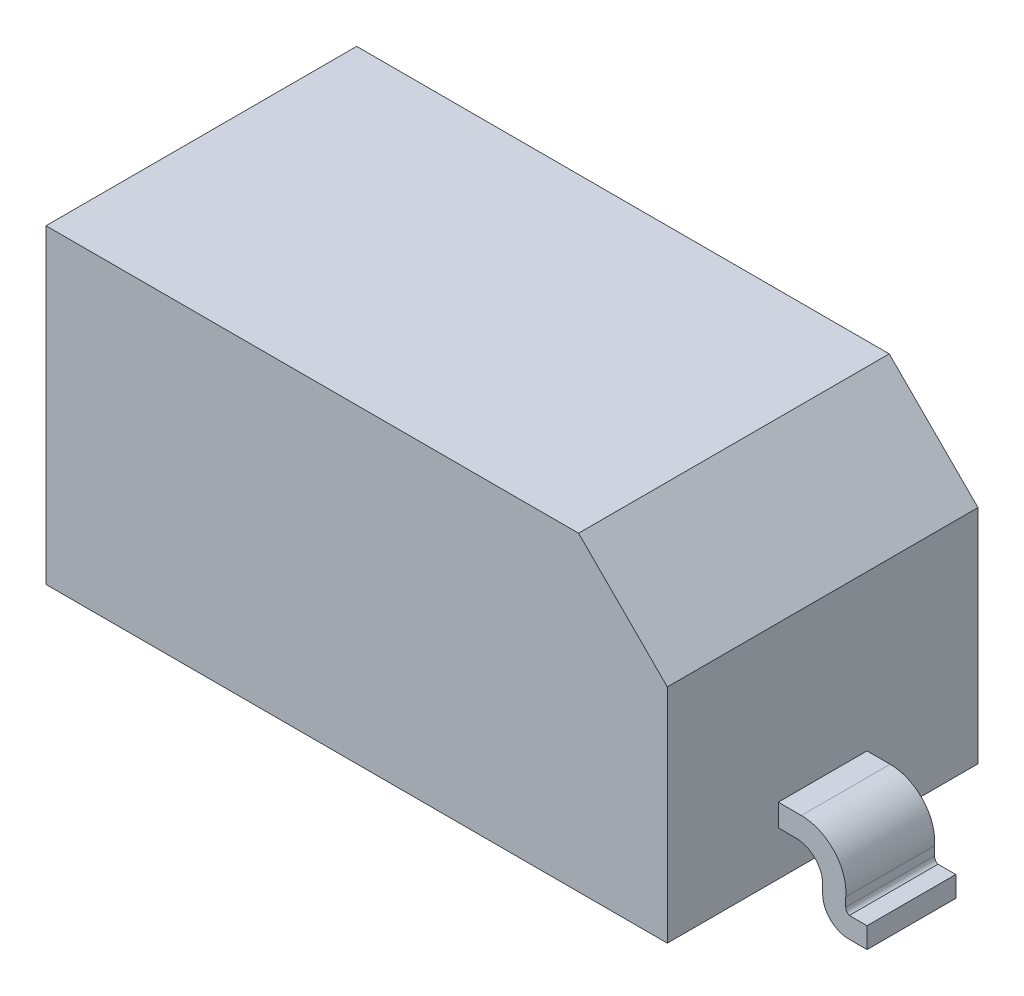
ISO-10303-21;
HEADER;
FILE_DESCRIPTION(('STEP AP214'),'2;1');
FILE_NAME('part.step','',(''),(''),'','','');
FILE_SCHEMA(('AUTOMOTIVE_DESIGN { 1 0 10303 214 1 1 1 1 }'));
ENDSEC;
DATA;
#1=APPLICATION_CONTEXT('core data for automotive mechanical design processes');
#2=APPLICATION_PROTOCOL_DEFINITION('international standard','automotive_design',2000,#1);
#3=PRODUCT_CONTEXT('',#1,'mechanical');
#4=PRODUCT('Part','Part','',(#3));
#5=PRODUCT_RELATED_PRODUCT_CATEGORY('part','',(#4));
#6=PRODUCT_DEFINITION_FORMATION('','',#4);
#7=PRODUCT_DEFINITION_CONTEXT('part definition',#1,'design');
#8=PRODUCT_DEFINITION('design','',#6,#7);
#9=PRODUCT_DEFINITION_SHAPE('','',#8);
#10=(LENGTH_UNIT() NAMED_UNIT(*) SI_UNIT(.MILLI.,.METRE.));
#11=(NAMED_UNIT(*) PLANE_ANGLE_UNIT() SI_UNIT($,.RADIAN.));
#12=(NAMED_UNIT(*) SI_UNIT($,.STERADIAN.) SOLID_ANGLE_UNIT());
#13=UNCERTAINTY_MEASURE_WITH_UNIT(LENGTH_MEASURE(1.E-05),#10,'distance_accuracy_value','');
#14=(GEOMETRIC_REPRESENTATION_CONTEXT(3) GLOBAL_UNCERTAINTY_ASSIGNED_CONTEXT((#13)) GLOBAL_UNIT_ASSIGNED_CONTEXT((#10,
#11,#12)) REPRESENTATION_CONTEXT('',''));
#15=CARTESIAN_POINT('',(0.,0.,0.));
#16=DIRECTION('',(0.,0.,1.));
#17=DIRECTION('',(1.,0.,0.));
#18=AXIS2_PLACEMENT_3D('',#15,#16,#17);
#19=CARTESIAN_POINT('',(-1.75,0.875,0.875));
#20=DIRECTION('',(1.,0.,0.));
#21=DIRECTION('',(0.,0.,-1.));
#22=AXIS2_PLACEMENT_3D('',#19,#20,#21);
#23=PLANE('',#22);
#24=DIRECTION('',(0.,-1.,0.));
#25=VECTOR('',#24,1.);
#26=CARTESIAN_POINT('',(-1.75,0.875,-0.875));
#27=LINE('',#26,#25);
#28=CARTESIAN_POINT('',(-1.75,0.875,-0.875));
#29=VERTEX_POINT('',#28);
#30=CARTESIAN_POINT('',(-1.75,-0.875,-0.875));
#31=VERTEX_POINT('',#30);
#32=EDGE_CURVE('E337',#29,#31,#27,.T.);
#33=ORIENTED_EDGE('',*,*,#32,.T.);
#34=DIRECTION('',(0.,0.,-1.));
#35=VECTOR('',#34,1.);
#36=CARTESIAN_POINT('',(-1.75,-0.875,0.875));
#37=LINE('',#36,#35);
#38=CARTESIAN_POINT('',(-1.75,-0.875,0.875));
#39=VERTEX_POINT('',#38);
#40=EDGE_CURVE('E11',#39,#31,#37,.T.);
#41=ORIENTED_EDGE('',*,*,#40,.F.);
#42=DIRECTION('',(0.,-1.,0.));
#43=VECTOR('',#42,1.);
#44=CARTESIAN_POINT('',(-1.75,0.875,0.875));
#45=LINE('',#44,#43);
#46=CARTESIAN_POINT('',(-1.75,0.875,0.875));
#47=VERTEX_POINT('',#46);
#48=EDGE_CURVE('E338',#47,#39,#45,.T.);
#49=ORIENTED_EDGE('',*,*,#48,.F.);
#50=DIRECTION('',(0.,0.,-1.));
#51=VECTOR('',#50,1.);
#52=CARTESIAN_POINT('',(-1.75,0.875,0.875));
#53=LINE('',#52,#51);
#54=EDGE_CURVE('E350',#47,#29,#53,.T.);
#55=ORIENTED_EDGE('',*,*,#54,.T.);
#56=EDGE_LOOP('',(#33,#41,#49,#55));
#57=FACE_BOUND('',#56,.T.);
#58=DIRECTION('',(0.,-1.,0.));
#59=VECTOR('',#58,1.);
#60=CARTESIAN_POINT('',(-1.75,-0.625,0.25));
#61=LINE('',#60,#59);
#62=CARTESIAN_POINT('',(-1.75,-0.49948491419278,0.25));
#63=VERTEX_POINT('',#62);
#64=CARTESIAN_POINT('',(-1.75,-0.625,0.25));
#65=VERTEX_POINT('',#64);
#66=EDGE_CURVE('E226',#63,#65,#61,.T.);
#67=ORIENTED_EDGE('',*,*,#66,.T.);
#68=DIRECTION('',(0.,0.,-1.));
#69=VECTOR('',#68,1.);
#70=CARTESIAN_POINT('',(-1.75,-0.625,0.25));
#71=LINE('',#70,#69);
#72=CARTESIAN_POINT('',(-1.75,-0.625,-0.25));
#73=VERTEX_POINT('',#72);
#74=EDGE_CURVE('E707',#65,#73,#71,.T.);
#75=ORIENTED_EDGE('',*,*,#74,.T.);
#76=DIRECTION('',(0.,-1.,0.));
#77=VECTOR('',#76,1.);
#78=CARTESIAN_POINT('',(-1.75,-0.625,-0.25));
#79=LINE('',#78,#77);
#80=CARTESIAN_POINT('',(-1.75,-0.499484914192779,-0.25));
#81=VERTEX_POINT('',#80);
#82=EDGE_CURVE('E247',#81,#73,#79,.T.);
#83=ORIENTED_EDGE('',*,*,#82,.F.);
#84=DIRECTION('',(0.,0.,-1.));
#85=VECTOR('',#84,1.);
#86=CARTESIAN_POINT('',(-1.75,-0.49948491419278,0.25));
#87=LINE('',#86,#85);
#88=EDGE_CURVE('E242',#63,#81,#87,.T.);
#89=ORIENTED_EDGE('',*,*,#88,.F.);
#90=EDGE_LOOP('',(#67,#75,#83,#89));
#91=FACE_BOUND('',#90,.T.);
#92=ADVANCED_FACE('F34',(#57,#91),#23,.F.);
#93=CARTESIAN_POINT('',(1.75,-0.874999999999999,0.875));
#94=DIRECTION('',(-1.,0.,0.));
#95=DIRECTION('',(0.,-1.,0.));
#96=AXIS2_PLACEMENT_3D('',#93,#94,#95);
#97=PLANE('',#96);
#98=DIRECTION('',(0.,1.,0.));
#99=VECTOR('',#98,1.);
#100=CARTESIAN_POINT('',(1.75,-0.874999999999999,-0.875));
#101=LINE('',#100,#99);
#102=CARTESIAN_POINT('',(1.75,-0.874999999999999,-0.875));
#103=VERTEX_POINT('',#102);
#104=CARTESIAN_POINT('',(1.75,0.375000000000001,-0.875));
#105=VERTEX_POINT('',#104);
#106=EDGE_CURVE('E355',#103,#105,#101,.T.);
#107=ORIENTED_EDGE('',*,*,#106,.T.);
#108=DIRECTION('',(0.,0.,-1.));
#109=VECTOR('',#108,1.);
#110=CARTESIAN_POINT('',(1.75,0.375000000000001,0.875));
#111=LINE('',#110,#109);
#112=CARTESIAN_POINT('',(1.75,0.375000000000001,0.875));
#113=VERTEX_POINT('',#112);
#114=EDGE_CURVE('E365',#113,#105,#111,.T.);
#115=ORIENTED_EDGE('',*,*,#114,.F.);
#116=DIRECTION('',(0.,1.,0.));
#117=VECTOR('',#116,1.);
#118=CARTESIAN_POINT('',(1.75,-0.874999999999999,0.875));
#119=LINE('',#118,#117);
#120=CARTESIAN_POINT('',(1.75,-0.874999999999999,0.875));
#121=VERTEX_POINT('',#120);
#122=EDGE_CURVE('E344',#121,#113,#119,.T.);
#123=ORIENTED_EDGE('',*,*,#122,.F.);
#124=DIRECTION('',(0.,0.,-1.));
#125=VECTOR('',#124,1.);
#126=CARTESIAN_POINT('',(1.75,-0.874999999999999,0.875));
#127=LINE('',#126,#125);
#128=EDGE_CURVE('E41',#121,#103,#127,.T.);
#129=ORIENTED_EDGE('',*,*,#128,.T.);
#130=EDGE_LOOP('',(#107,#115,#123,#129));
#131=FACE_BOUND('',#130,.T.);
#132=DIRECTION('',(0.,-1.,0.));
#133=VECTOR('',#132,1.);
#134=CARTESIAN_POINT('',(1.75,-0.625,0.25));
#135=LINE('',#134,#133);
#136=CARTESIAN_POINT('',(1.75,-0.49948491419278,0.25));
#137=VERTEX_POINT('',#136);
#138=CARTESIAN_POINT('',(1.75,-0.625,0.25));
#139=VERTEX_POINT('',#138);
#140=EDGE_CURVE('E257',#137,#139,#135,.T.);
#141=ORIENTED_EDGE('',*,*,#140,.F.);
#142=DIRECTION('',(0.,0.,-1.));
#143=VECTOR('',#142,1.);
#144=CARTESIAN_POINT('',(1.75,-0.49948491419278,0.25));
#145=LINE('',#144,#143);
#146=CARTESIAN_POINT('',(1.75,-0.49948491419278,-0.25));
#147=VERTEX_POINT('',#146);
#148=EDGE_CURVE('E282',#137,#147,#145,.T.);
#149=ORIENTED_EDGE('',*,*,#148,.T.);
#150=DIRECTION('',(0.,-1.,0.));
#151=VECTOR('',#150,1.);
#152=CARTESIAN_POINT('',(1.75,-0.625,-0.25));
#153=LINE('',#152,#151);
#154=CARTESIAN_POINT('',(1.75,-0.625,-0.25));
#155=VERTEX_POINT('',#154);
#156=EDGE_CURVE('E248',#147,#155,#153,.T.);
#157=ORIENTED_EDGE('',*,*,#156,.T.);
#158=DIRECTION('',(0.,0.,-1.));
#159=VECTOR('',#158,1.);
#160=CARTESIAN_POINT('',(1.75,-0.625,0.25));
#161=LINE('',#160,#159);
#162=EDGE_CURVE('E56',#139,#155,#161,.T.);
#163=ORIENTED_EDGE('',*,*,#162,.F.);
#164=EDGE_LOOP('',(#141,#149,#157,#163));
#165=FACE_BOUND('',#164,.T.);
#166=ADVANCED_FACE('F372',(#131,#165),#97,.F.);
#167=CARTESIAN_POINT('',(-1.75,-0.875,0.875));
#168=DIRECTION('',(0.,1.,0.));
#169=DIRECTION('',(-1.,0.,0.));
#170=AXIS2_PLACEMENT_3D('',#167,#168,#169);
#171=PLANE('',#170);
#172=DIRECTION('',(1.,0.,0.));
#173=VECTOR('',#172,1.);
#174=CARTESIAN_POINT('',(-1.75,-0.875,-0.875));
#175=LINE('',#174,#173);
#176=EDGE_CURVE('E353',#31,#103,#175,.T.);
#177=ORIENTED_EDGE('',*,*,#176,.T.);
#178=ORIENTED_EDGE('',*,*,#128,.F.);
#179=DIRECTION('',(1.,0.,0.));
#180=VECTOR('',#179,1.);
#181=CARTESIAN_POINT('',(-1.75,-0.875,0.875));
#182=LINE('',#181,#180);
#183=EDGE_CURVE('E341',#39,#121,#182,.T.);
#184=ORIENTED_EDGE('',*,*,#183,.F.);
#185=ORIENTED_EDGE('',*,*,#40,.T.);
#186=EDGE_LOOP('',(#177,#178,#184,#185));
#187=FACE_BOUND('',#186,.T.);
#188=ADVANCED_FACE('F393',(#187),#171,.F.);
#189=CARTESIAN_POINT('',(1.75,0.375000000000001,0.875));
#190=DIRECTION('',(-0.707106781186548,-0.707106781186547,0.));
#191=DIRECTION('',(0.707106781186547,-0.707106781186548,0.));
#192=AXIS2_PLACEMENT_3D('',#189,#190,#191);
#193=PLANE('',#192);
#194=DIRECTION('',(-0.707106781186547,0.707106781186548,0.));
#195=VECTOR('',#194,1.);
#196=CARTESIAN_POINT('',(1.75,0.375000000000001,-0.875));
#197=LINE('',#196,#195);
#198=CARTESIAN_POINT('',(1.25,0.875,-0.875));
#199=VERTEX_POINT('',#198);
#200=EDGE_CURVE('E357',#105,#199,#197,.T.);
#201=ORIENTED_EDGE('',*,*,#200,.T.);
#202=DIRECTION('',(0.,0.,-1.));
#203=VECTOR('',#202,1.);
#204=CARTESIAN_POINT('',(1.25,0.875,0.875));
#205=LINE('',#204,#203);
#206=CARTESIAN_POINT('',(1.25,0.875,0.875));
#207=VERTEX_POINT('',#206);
#208=EDGE_CURVE('E362',#207,#199,#205,.T.);
#209=ORIENTED_EDGE('',*,*,#208,.F.);
#210=DIRECTION('',(-0.707106781186547,0.707106781186548,0.));
#211=VECTOR('',#210,1.);
#212=CARTESIAN_POINT('',(1.75,0.375000000000001,0.875));
#213=LINE('',#212,#211);
#214=EDGE_CURVE('E346',#113,#207,#213,.T.);
#215=ORIENTED_EDGE('',*,*,#214,.F.);
#216=ORIENTED_EDGE('',*,*,#114,.T.);
#217=EDGE_LOOP('',(#201,#209,#215,#216));
#218=FACE_BOUND('',#217,.T.);
#219=ADVANCED_FACE('F383',(#218),#193,.F.);
#220=CARTESIAN_POINT('',(1.25,0.875,0.875));
#221=DIRECTION('',(0.,-1.,0.));
#222=DIRECTION('',(0.,0.,-1.));
#223=AXIS2_PLACEMENT_3D('',#220,#221,#222);
#224=PLANE('',#223);
#225=DIRECTION('',(-1.,0.,0.));
#226=VECTOR('',#225,1.);
#227=CARTESIAN_POINT('',(1.25,0.875,-0.875));
#228=LINE('',#227,#226);
#229=EDGE_CURVE('E342',#199,#29,#228,.T.);
#230=ORIENTED_EDGE('',*,*,#229,.T.);
#231=ORIENTED_EDGE('',*,*,#54,.F.);
#232=DIRECTION('',(-1.,0.,0.));
#233=VECTOR('',#232,1.);
#234=CARTESIAN_POINT('',(1.25,0.875,0.875));
#235=LINE('',#234,#233);
#236=EDGE_CURVE('E348',#207,#47,#235,.T.);
#237=ORIENTED_EDGE('',*,*,#236,.F.);
#238=ORIENTED_EDGE('',*,*,#208,.T.);
#239=EDGE_LOOP('',(#230,#231,#237,#238));
#240=FACE_BOUND('',#239,.T.);
#241=ADVANCED_FACE('F387',(#240),#224,.F.);
#242=CARTESIAN_POINT('',(-1.75,0.875,0.875));
#243=DIRECTION('',(0.,0.,-1.));
#244=DIRECTION('',(-1.,0.,0.));
#245=AXIS2_PLACEMENT_3D('',#242,#243,#244);
#246=PLANE('',#245);
#247=ORIENTED_EDGE('',*,*,#48,.T.);
#248=ORIENTED_EDGE('',*,*,#183,.T.);
#249=ORIENTED_EDGE('',*,*,#122,.T.);
#250=ORIENTED_EDGE('',*,*,#214,.T.);
#251=ORIENTED_EDGE('',*,*,#236,.T.);
#252=EDGE_LOOP('',(#247,#248,#249,#250,#251));
#253=FACE_BOUND('',#252,.T.);
#254=ADVANCED_FACE('F391',(#253),#246,.F.);
#255=CARTESIAN_POINT('',(-1.75,0.875,-0.875));
#256=DIRECTION('',(0.,0.,-1.));
#257=DIRECTION('',(-1.,0.,0.));
#258=AXIS2_PLACEMENT_3D('',#255,#256,#257);
#259=PLANE('',#258);
#260=ORIENTED_EDGE('',*,*,#32,.F.);
#261=ORIENTED_EDGE('',*,*,#229,.F.);
#262=ORIENTED_EDGE('',*,*,#200,.F.);
#263=ORIENTED_EDGE('',*,*,#106,.F.);
#264=ORIENTED_EDGE('',*,*,#176,.F.);
#265=EDGE_LOOP('',(#260,#261,#262,#263,#264));
#266=FACE_BOUND('',#265,.T.);
#267=ADVANCED_FACE('F379',(#266),#259,.T.);
#268=CARTESIAN_POINT('',(1.75,-0.625,0.25));
#269=DIRECTION('',(0.,1.,0.));
#270=DIRECTION('',(0.,0.,1.));
#271=AXIS2_PLACEMENT_3D('',#268,#269,#270);
#272=PLANE('',#271);
#273=DIRECTION('',(1.,0.,0.));
#274=VECTOR('',#273,1.);
#275=CARTESIAN_POINT('',(1.75,-0.625,-0.25));
#276=LINE('',#275,#274);
#277=CARTESIAN_POINT('',(1.85,-0.625,-0.25));
#278=VERTEX_POINT('',#277);
#279=EDGE_CURVE('E251',#155,#278,#276,.T.);
#280=ORIENTED_EDGE('',*,*,#279,.T.);
#281=DIRECTION('',(0.,0.,-1.));
#282=VECTOR('',#281,1.);
#283=CARTESIAN_POINT('',(1.85,-0.625,0.25));
#284=LINE('',#283,#282);
#285=CARTESIAN_POINT('',(1.85,-0.625,0.25));
#286=VERTEX_POINT('',#285);
#287=EDGE_CURVE('E333',#286,#278,#284,.T.);
#288=ORIENTED_EDGE('',*,*,#287,.F.);
#289=DIRECTION('',(1.,0.,0.));
#290=VECTOR('',#289,1.);
#291=CARTESIAN_POINT('',(1.75,-0.625,0.25));
#292=LINE('',#291,#290);
#293=EDGE_CURVE('E260',#139,#286,#292,.T.);
#294=ORIENTED_EDGE('',*,*,#293,.F.);
#295=ORIENTED_EDGE('',*,*,#162,.T.);
#296=EDGE_LOOP('',(#280,#288,#294,#295));
#297=FACE_BOUND('',#296,.T.);
#298=ADVANCED_FACE('F410',(#297),#272,.F.);
#299=CARTESIAN_POINT('',(1.85,-0.77503124674547,0.25));
#300=DIRECTION('',(0.,0.,-1.));
#301=DIRECTION('',(-1.,0.,0.));
#302=AXIS2_PLACEMENT_3D('',#299,#300,#301);
#303=CYLINDRICAL_SURFACE('',#302,0.15003124674547);
#304=CARTESIAN_POINT('',(1.85,-0.77503124674547,-0.25));
#305=DIRECTION('',(0.,0.,-1.));
#306=DIRECTION('',(-1.,0.,0.));
#307=AXIS2_PLACEMENT_3D('',#304,#305,#306);
#308=CIRCLE('',#307,0.15003124674547);
#309=CARTESIAN_POINT('',(2.,-0.771969384566991,-0.25));
#310=VERTEX_POINT('',#309);
#311=EDGE_CURVE('E285',#278,#310,#308,.T.);
#312=ORIENTED_EDGE('',*,*,#311,.T.);
#313=DIRECTION('',(0.,0.,-1.));
#314=VECTOR('',#313,1.);
#315=CARTESIAN_POINT('',(2.,-0.771969384566991,0.25));
#316=LINE('',#315,#314);
#317=CARTESIAN_POINT('',(2.,-0.771969384566991,0.25));
#318=VERTEX_POINT('',#317);
#319=EDGE_CURVE('E330',#318,#310,#316,.T.);
#320=ORIENTED_EDGE('',*,*,#319,.F.);
#321=CARTESIAN_POINT('',(1.85,-0.77503124674547,0.25));
#322=DIRECTION('',(0.,0.,-1.));
#323=DIRECTION('',(-1.,0.,0.));
#324=AXIS2_PLACEMENT_3D('',#321,#322,#323);
#325=CIRCLE('',#324,0.15003124674547);
#326=EDGE_CURVE('E263',#286,#318,#325,.T.);
#327=ORIENTED_EDGE('',*,*,#326,.F.);
#328=ORIENTED_EDGE('',*,*,#287,.T.);
#329=EDGE_LOOP('',(#312,#320,#327,#328));
#330=FACE_BOUND('',#329,.T.);
#331=ADVANCED_FACE('F415',(#330),#303,.F.);
#332=CARTESIAN_POINT('',(2.,-0.771969384566991,0.25));
#333=DIRECTION('',(1.,0.,0.));
#334=DIRECTION('',(0.,0.,-1.));
#335=AXIS2_PLACEMENT_3D('',#332,#333,#334);
#336=PLANE('',#335);
#337=DIRECTION('',(0.,-1.,0.));
#338=VECTOR('',#337,1.);
#339=CARTESIAN_POINT('',(2.,-0.771969384566991,-0.25));
#340=LINE('',#339,#338);
#341=CARTESIAN_POINT('',(2.,-0.821969384566991,-0.25));
#342=VERTEX_POINT('',#341);
#343=EDGE_CURVE('E287',#310,#342,#340,.T.);
#344=ORIENTED_EDGE('',*,*,#343,.T.);
#345=DIRECTION('',(0.,0.,-1.));
#346=VECTOR('',#345,1.);
#347=CARTESIAN_POINT('',(2.,-0.821969384566991,0.25));
#348=LINE('',#347,#346);
#349=CARTESIAN_POINT('',(2.,-0.821969384566991,0.25));
#350=VERTEX_POINT('',#349);
#351=EDGE_CURVE('E327',#350,#342,#348,.T.);
#352=ORIENTED_EDGE('',*,*,#351,.F.);
#353=DIRECTION('',(0.,-1.,0.));
#354=VECTOR('',#353,1.);
#355=CARTESIAN_POINT('',(2.,-0.771969384566991,0.25));
#356=LINE('',#355,#354);
#357=EDGE_CURVE('E265',#318,#350,#356,.T.);
#358=ORIENTED_EDGE('',*,*,#357,.F.);
#359=ORIENTED_EDGE('',*,*,#319,.T.);
#360=EDGE_LOOP('',(#344,#352,#358,#359));
#361=FACE_BOUND('',#360,.T.);
#362=ADVANCED_FACE('F418',(#361),#336,.F.);
#363=CARTESIAN_POINT('',(2.147,-0.821969384566991,0.25));
#364=DIRECTION('',(0.,0.,-1.));
#365=DIRECTION('',(-1.,0.,0.));
#366=AXIS2_PLACEMENT_3D('',#363,#364,#365);
#367=CYLINDRICAL_SURFACE('',#366,0.147);
#368=CARTESIAN_POINT('',(2.147,-0.821969384566991,-0.25));
#369=DIRECTION('',(0.,0.,1.));
#370=DIRECTION('',(1.,0.,0.));
#371=AXIS2_PLACEMENT_3D('',#368,#369,#370);
#372=CIRCLE('',#371,0.147);
#373=CARTESIAN_POINT('',(2.15,-0.968938769133981,-0.25));
#374=VERTEX_POINT('',#373);
#375=EDGE_CURVE('E289',#342,#374,#372,.T.);
#376=ORIENTED_EDGE('',*,*,#375,.T.);
#377=DIRECTION('',(0.,0.,-1.));
#378=VECTOR('',#377,1.);
#379=CARTESIAN_POINT('',(2.15,-0.968938769133981,0.25));
#380=LINE('',#379,#378);
#381=CARTESIAN_POINT('',(2.15,-0.968938769133981,0.25));
#382=VERTEX_POINT('',#381);
#383=EDGE_CURVE('E324',#382,#374,#380,.T.);
#384=ORIENTED_EDGE('',*,*,#383,.F.);
#385=CARTESIAN_POINT('',(2.147,-0.821969384566991,0.25));
#386=DIRECTION('',(0.,0.,1.));
#387=DIRECTION('',(1.,0.,0.));
#388=AXIS2_PLACEMENT_3D('',#385,#386,#387);
#389=CIRCLE('',#388,0.147);
#390=EDGE_CURVE('E267',#350,#382,#389,.T.);
#391=ORIENTED_EDGE('',*,*,#390,.F.);
#392=ORIENTED_EDGE('',*,*,#351,.T.);
#393=EDGE_LOOP('',(#376,#384,#391,#392));
#394=FACE_BOUND('',#393,.T.);
#395=ADVANCED_FACE('F422',(#394),#367,.T.);
#396=CARTESIAN_POINT('',(2.25,-0.968938769133981,0.25));
#397=DIRECTION('',(0.,1.,0.));
#398=DIRECTION('',(0.,0.,1.));
#399=AXIS2_PLACEMENT_3D('',#396,#397,#398);
#400=PLANE('',#399);
#401=DIRECTION('',(1.,0.,0.));
#402=VECTOR('',#401,1.);
#403=CARTESIAN_POINT('',(2.25,-0.968938769133981,-0.25));
#404=LINE('',#403,#402);
#405=CARTESIAN_POINT('',(2.25,-0.968938769133981,-0.25));
#406=VERTEX_POINT('',#405);
#407=EDGE_CURVE('E291',#374,#406,#404,.T.);
#408=ORIENTED_EDGE('',*,*,#407,.T.);
#409=DIRECTION('',(0.,0.,-1.));
#410=VECTOR('',#409,1.);
#411=CARTESIAN_POINT('',(2.25,-0.968938769133981,0.25));
#412=LINE('',#411,#410);
#413=CARTESIAN_POINT('',(2.25,-0.968938769133981,0.25));
#414=VERTEX_POINT('',#413);
#415=EDGE_CURVE('E321',#414,#406,#412,.T.);
#416=ORIENTED_EDGE('',*,*,#415,.F.);
#417=DIRECTION('',(1.,0.,0.));
#418=VECTOR('',#417,1.);
#419=CARTESIAN_POINT('',(2.25,-0.968938769133981,0.25));
#420=LINE('',#419,#418);
#421=EDGE_CURVE('E269',#382,#414,#420,.T.);
#422=ORIENTED_EDGE('',*,*,#421,.F.);
#423=ORIENTED_EDGE('',*,*,#383,.T.);
#424=EDGE_LOOP('',(#408,#416,#422,#423));
#425=FACE_BOUND('',#424,.T.);
#426=ADVANCED_FACE('F426',(#425),#400,.F.);
#427=CARTESIAN_POINT('',(2.25,-0.852248548132497,0.25));
#428=DIRECTION('',(-1.,0.,0.));
#429=DIRECTION('',(0.,0.,1.));
#430=AXIS2_PLACEMENT_3D('',#427,#428,#429);
#431=PLANE('',#430);
#432=DIRECTION('',(0.,1.,0.));
#433=VECTOR('',#432,1.);
#434=CARTESIAN_POINT('',(2.25,-0.852248548132497,-0.25));
#435=LINE('',#434,#433);
#436=CARTESIAN_POINT('',(2.25,-0.852248548132497,-0.25));
#437=VERTEX_POINT('',#436);
#438=EDGE_CURVE('E293',#406,#437,#435,.T.);
#439=ORIENTED_EDGE('',*,*,#438,.T.);
#440=DIRECTION('',(0.,0.,-1.));
#441=VECTOR('',#440,1.);
#442=CARTESIAN_POINT('',(2.25,-0.852248548132497,0.25));
#443=LINE('',#442,#441);
#444=CARTESIAN_POINT('',(2.25,-0.852248548132497,0.25));
#445=VERTEX_POINT('',#444);
#446=EDGE_CURVE('E318',#445,#437,#443,.T.);
#447=ORIENTED_EDGE('',*,*,#446,.F.);
#448=DIRECTION('',(0.,1.,0.));
#449=VECTOR('',#448,1.);
#450=CARTESIAN_POINT('',(2.25,-0.852248548132497,0.25));
#451=LINE('',#450,#449);
#452=EDGE_CURVE('E271',#414,#445,#451,.T.);
#453=ORIENTED_EDGE('',*,*,#452,.F.);
#454=ORIENTED_EDGE('',*,*,#415,.T.);
#455=EDGE_LOOP('',(#439,#447,#453,#454));
#456=FACE_BOUND('',#455,.T.);
#457=ADVANCED_FACE('F430',(#456),#431,.F.);
#458=CARTESIAN_POINT('',(2.15,-0.852248548132497,0.25));
#459=DIRECTION('',(0.,-1.,0.));
#460=DIRECTION('',(0.,0.,-1.));
#461=AXIS2_PLACEMENT_3D('',#458,#459,#460);
#462=PLANE('',#461);
#463=DIRECTION('',(-1.,0.,0.));
#464=VECTOR('',#463,1.);
#465=CARTESIAN_POINT('',(2.15,-0.852248548132497,-0.25));
#466=LINE('',#465,#464);
#467=CARTESIAN_POINT('',(2.15,-0.852248548132497,-0.25));
#468=VERTEX_POINT('',#467);
#469=EDGE_CURVE('E295',#437,#468,#466,.T.);
#470=ORIENTED_EDGE('',*,*,#469,.T.);
#471=DIRECTION('',(0.,0.,-1.));
#472=VECTOR('',#471,1.);
#473=CARTESIAN_POINT('',(2.15,-0.852248548132497,0.25));
#474=LINE('',#473,#472);
#475=CARTESIAN_POINT('',(2.15,-0.852248548132497,0.25));
#476=VERTEX_POINT('',#475);
#477=EDGE_CURVE('E315',#476,#468,#474,.T.);
#478=ORIENTED_EDGE('',*,*,#477,.F.);
#479=DIRECTION('',(-1.,0.,0.));
#480=VECTOR('',#479,1.);
#481=CARTESIAN_POINT('',(2.15,-0.852248548132497,0.25));
#482=LINE('',#481,#480);
#483=EDGE_CURVE('E273',#445,#476,#482,.T.);
#484=ORIENTED_EDGE('',*,*,#483,.F.);
#485=ORIENTED_EDGE('',*,*,#446,.T.);
#486=EDGE_LOOP('',(#470,#478,#484,#485));
#487=FACE_BOUND('',#486,.T.);
#488=ADVANCED_FACE('F434',(#487),#462,.F.);
#489=CARTESIAN_POINT('',(2.1625,-0.822248548132497,0.25));
#490=DIRECTION('',(0.,0.,-1.));
#491=DIRECTION('',(-1.,0.,0.));
#492=AXIS2_PLACEMENT_3D('',#489,#490,#491);
#493=CYLINDRICAL_SURFACE('',#492,0.0324999999999995);
#494=CARTESIAN_POINT('',(2.1625,-0.822248548132497,-0.25));
#495=DIRECTION('',(0.,0.,-1.));
#496=DIRECTION('',(1.,0.,0.));
#497=AXIS2_PLACEMENT_3D('',#494,#495,#496);
#498=CIRCLE('',#497,0.0324999999999995);
#499=CARTESIAN_POINT('',(2.13,-0.822248548132497,-0.25));
#500=VERTEX_POINT('',#499);
#501=EDGE_CURVE('E297',#468,#500,#498,.T.);
#502=ORIENTED_EDGE('',*,*,#501,.T.);
#503=DIRECTION('',(0.,0.,-1.));
#504=VECTOR('',#503,1.);
#505=CARTESIAN_POINT('',(2.13,-0.822248548132497,0.25));
#506=LINE('',#505,#504);
#507=CARTESIAN_POINT('',(2.13,-0.822248548132497,0.25));
#508=VERTEX_POINT('',#507);
#509=EDGE_CURVE('E312',#508,#500,#506,.T.);
#510=ORIENTED_EDGE('',*,*,#509,.F.);
#511=CARTESIAN_POINT('',(2.1625,-0.822248548132497,0.25));
#512=DIRECTION('',(0.,0.,-1.));
#513=DIRECTION('',(1.,0.,0.));
#514=AXIS2_PLACEMENT_3D('',#511,#512,#513);
#515=CIRCLE('',#514,0.0324999999999995);
#516=EDGE_CURVE('E275',#476,#508,#515,.T.);
#517=ORIENTED_EDGE('',*,*,#516,.F.);
#518=ORIENTED_EDGE('',*,*,#477,.T.);
#519=EDGE_LOOP('',(#502,#510,#517,#518));
#520=FACE_BOUND('',#519,.T.);
#521=ADVANCED_FACE('F438',(#520),#493,.F.);
#522=CARTESIAN_POINT('',(2.13,-0.772248548132497,0.25));
#523=DIRECTION('',(-1.,0.,0.));
#524=DIRECTION('',(0.,0.,1.));
#525=AXIS2_PLACEMENT_3D('',#522,#523,#524);
#526=PLANE('',#525);
#527=DIRECTION('',(0.,1.,0.));
#528=VECTOR('',#527,1.);
#529=CARTESIAN_POINT('',(2.13,-0.772248548132497,-0.25));
#530=LINE('',#529,#528);
#531=CARTESIAN_POINT('',(2.13,-0.772248548132497,-0.25));
#532=VERTEX_POINT('',#531);
#533=EDGE_CURVE('E299',#500,#532,#530,.T.);
#534=ORIENTED_EDGE('',*,*,#533,.T.);
#535=DIRECTION('',(0.,0.,-1.));
#536=VECTOR('',#535,1.);
#537=CARTESIAN_POINT('',(2.13,-0.772248548132497,0.25));
#538=LINE('',#537,#536);
#539=CARTESIAN_POINT('',(2.13,-0.772248548132497,0.25));
#540=VERTEX_POINT('',#539);
#541=EDGE_CURVE('E309',#540,#532,#538,.T.);
#542=ORIENTED_EDGE('',*,*,#541,.F.);
#543=DIRECTION('',(0.,1.,0.));
#544=VECTOR('',#543,1.);
#545=CARTESIAN_POINT('',(2.13,-0.772248548132497,0.25));
#546=LINE('',#545,#544);
#547=EDGE_CURVE('E277',#508,#540,#546,.T.);
#548=ORIENTED_EDGE('',*,*,#547,.F.);
#549=ORIENTED_EDGE('',*,*,#509,.T.);
#550=EDGE_LOOP('',(#534,#542,#548,#549));
#551=FACE_BOUND('',#550,.T.);
#552=ADVANCED_FACE('F442',(#551),#526,.F.);
#553=CARTESIAN_POINT('',(1.88,-0.75043478977307,0.25));
#554=DIRECTION('',(0.,0.,-1.));
#555=DIRECTION('',(-1.,0.,0.));
#556=AXIS2_PLACEMENT_3D('',#553,#554,#555);
#557=CYLINDRICAL_SURFACE('',#556,0.250949875580291);
#558=CARTESIAN_POINT('',(1.88,-0.75043478977307,-0.25));
#559=DIRECTION('',(0.,0.,1.));
#560=DIRECTION('',(-1.,0.,0.));
#561=AXIS2_PLACEMENT_3D('',#558,#559,#560);
#562=CIRCLE('',#561,0.250949875580291);
#563=CARTESIAN_POINT('',(1.88,-0.49948491419278,-0.25));
#564=VERTEX_POINT('',#563);
#565=EDGE_CURVE('E301',#532,#564,#562,.T.);
#566=ORIENTED_EDGE('',*,*,#565,.T.);
#567=DIRECTION('',(0.,0.,-1.));
#568=VECTOR('',#567,1.);
#569=CARTESIAN_POINT('',(1.88,-0.49948491419278,0.25));
#570=LINE('',#569,#568);
#571=CARTESIAN_POINT('',(1.88,-0.49948491419278,0.25));
#572=VERTEX_POINT('',#571);
#573=EDGE_CURVE('E306',#572,#564,#570,.T.);
#574=ORIENTED_EDGE('',*,*,#573,.F.);
#575=CARTESIAN_POINT('',(1.88,-0.75043478977307,0.25));
#576=DIRECTION('',(0.,0.,1.));
#577=DIRECTION('',(-1.,0.,0.));
#578=AXIS2_PLACEMENT_3D('',#575,#576,#577);
#579=CIRCLE('',#578,0.250949875580291);
#580=EDGE_CURVE('E279',#540,#572,#579,.T.);
#581=ORIENTED_EDGE('',*,*,#580,.F.);
#582=ORIENTED_EDGE('',*,*,#541,.T.);
#583=EDGE_LOOP('',(#566,#574,#581,#582));
#584=FACE_BOUND('',#583,.T.);
#585=ADVANCED_FACE('F446',(#584),#557,.T.);
#586=CARTESIAN_POINT('',(1.75,-0.49948491419278,0.25));
#587=DIRECTION('',(0.,-1.,0.));
#588=DIRECTION('',(0.,0.,-1.));
#589=AXIS2_PLACEMENT_3D('',#586,#587,#588);
#590=PLANE('',#589);
#591=DIRECTION('',(-1.,0.,0.));
#592=VECTOR('',#591,1.);
#593=CARTESIAN_POINT('',(1.75,-0.49948491419278,-0.25));
#594=LINE('',#593,#592);
#595=EDGE_CURVE('E261',#564,#147,#594,.T.);
#596=ORIENTED_EDGE('',*,*,#595,.T.);
#597=ORIENTED_EDGE('',*,*,#148,.F.);
#598=DIRECTION('',(-1.,0.,0.));
#599=VECTOR('',#598,1.);
#600=CARTESIAN_POINT('',(1.75,-0.49948491419278,0.25));
#601=LINE('',#600,#599);
#602=EDGE_CURVE('E281',#572,#137,#601,.T.);
#603=ORIENTED_EDGE('',*,*,#602,.F.);
#604=ORIENTED_EDGE('',*,*,#573,.T.);
#605=EDGE_LOOP('',(#596,#597,#603,#604));
#606=FACE_BOUND('',#605,.T.);
#607=ADVANCED_FACE('F450',(#606),#590,.F.);
#608=CARTESIAN_POINT('',(1.88,-0.75043478977307,0.25));
#609=DIRECTION('',(0.,0.,-1.));
#610=DIRECTION('',(-1.,0.,0.));
#611=AXIS2_PLACEMENT_3D('',#608,#609,#610);
#612=PLANE('',#611);
#613=ORIENTED_EDGE('',*,*,#140,.T.);
#614=ORIENTED_EDGE('',*,*,#293,.T.);
#615=ORIENTED_EDGE('',*,*,#326,.T.);
#616=ORIENTED_EDGE('',*,*,#357,.T.);
#617=ORIENTED_EDGE('',*,*,#390,.T.);
#618=ORIENTED_EDGE('',*,*,#421,.T.);
#619=ORIENTED_EDGE('',*,*,#452,.T.);
#620=ORIENTED_EDGE('',*,*,#483,.T.);
#621=ORIENTED_EDGE('',*,*,#516,.T.);
#622=ORIENTED_EDGE('',*,*,#547,.T.);
#623=ORIENTED_EDGE('',*,*,#580,.T.);
#624=ORIENTED_EDGE('',*,*,#602,.T.);
#625=EDGE_LOOP('',(#613,#614,#615,#616,#617,#618,#619,#620,#621,#622,#623,#624));
#626=FACE_BOUND('',#625,.T.);
#627=ADVANCED_FACE('F454',(#626),#612,.F.);
#628=CARTESIAN_POINT('',(1.88,-0.75043478977307,-0.25));
#629=DIRECTION('',(0.,0.,-1.));
#630=DIRECTION('',(-1.,0.,0.));
#631=AXIS2_PLACEMENT_3D('',#628,#629,#630);
#632=PLANE('',#631);
#633=ORIENTED_EDGE('',*,*,#156,.F.);
#634=ORIENTED_EDGE('',*,*,#595,.F.);
#635=ORIENTED_EDGE('',*,*,#565,.F.);
#636=ORIENTED_EDGE('',*,*,#533,.F.);
#637=ORIENTED_EDGE('',*,*,#501,.F.);
#638=ORIENTED_EDGE('',*,*,#469,.F.);
#639=ORIENTED_EDGE('',*,*,#438,.F.);
#640=ORIENTED_EDGE('',*,*,#407,.F.);
#641=ORIENTED_EDGE('',*,*,#375,.F.);
#642=ORIENTED_EDGE('',*,*,#343,.F.);
#643=ORIENTED_EDGE('',*,*,#311,.F.);
#644=ORIENTED_EDGE('',*,*,#279,.F.);
#645=EDGE_LOOP('',(#633,#634,#635,#636,#637,#638,#639,#640,#641,#642,#643,#644));
#646=FACE_BOUND('',#645,.T.);
#647=ADVANCED_FACE('F456',(#646),#632,.T.);
#648=CARTESIAN_POINT('',(-1.75,-0.49948491419278,0.25));
#649=DIRECTION('',(0.,1.,0.));
#650=DIRECTION('',(0.,0.,1.));
#651=AXIS2_PLACEMENT_3D('',#648,#649,#650);
#652=PLANE('',#651);
#653=DIRECTION('',(1.,0.,0.));
#654=VECTOR('',#653,1.);
#655=CARTESIAN_POINT('',(-1.75,-0.49948491419278,-0.25));
#656=LINE('',#655,#654);
#657=CARTESIAN_POINT('',(-1.88,-0.49948491419278,-0.25));
#658=VERTEX_POINT('',#657);
#659=EDGE_CURVE('E48',#658,#81,#656,.T.);
#660=ORIENTED_EDGE('',*,*,#659,.F.);
#661=DIRECTION('',(0.,0.,-1.));
#662=VECTOR('',#661,1.);
#663=CARTESIAN_POINT('',(-1.88,-0.49948491419278,0.25));
#664=LINE('',#663,#662);
#665=CARTESIAN_POINT('',(-1.88,-0.49948491419278,0.25));
#666=VERTEX_POINT('',#665);
#667=EDGE_CURVE('E244',#666,#658,#664,.T.);
#668=ORIENTED_EDGE('',*,*,#667,.F.);
#669=DIRECTION('',(1.,0.,0.));
#670=VECTOR('',#669,1.);
#671=CARTESIAN_POINT('',(-1.75,-0.49948491419278,0.25));
#672=LINE('',#671,#670);
#673=EDGE_CURVE('E230',#666,#63,#672,.T.);
#674=ORIENTED_EDGE('',*,*,#673,.T.);
#675=ORIENTED_EDGE('',*,*,#88,.T.);
#676=EDGE_LOOP('',(#660,#668,#674,#675));
#677=FACE_BOUND('',#676,.T.);
#678=ADVANCED_FACE('F241',(#677),#652,.T.);
#679=CARTESIAN_POINT('',(-1.88,-0.75043478977307,0.25));
#680=DIRECTION('',(0.,0.,-1.));
#681=DIRECTION('',(-1.,0.,0.));
#682=AXIS2_PLACEMENT_3D('',#679,#680,#681);
#683=CYLINDRICAL_SURFACE('',#682,0.250949875580291);
#684=CARTESIAN_POINT('',(-1.88,-0.75043478977307,-0.25));
#685=DIRECTION('',(0.,0.,-1.));
#686=DIRECTION('',(1.,0.,0.));
#687=AXIS2_PLACEMENT_3D('',#684,#685,#686);
#688=CIRCLE('',#687,0.250949875580291);
#689=CARTESIAN_POINT('',(-2.13,-0.772248548132497,-0.25));
#690=VERTEX_POINT('',#689);
#691=EDGE_CURVE('E739',#690,#658,#688,.T.);
#692=ORIENTED_EDGE('',*,*,#691,.F.);
#693=DIRECTION('',(0.,0.,-1.));
#694=VECTOR('',#693,1.);
#695=CARTESIAN_POINT('',(-2.13,-0.772248548132497,0.25));
#696=LINE('',#695,#694);
#697=CARTESIAN_POINT('',(-2.13,-0.772248548132497,0.25));
#698=VERTEX_POINT('',#697);
#699=EDGE_CURVE('E253',#698,#690,#696,.T.);
#700=ORIENTED_EDGE('',*,*,#699,.F.);
#701=CARTESIAN_POINT('',(-1.88,-0.75043478977307,0.25));
#702=DIRECTION('',(0.,0.,-1.));
#703=DIRECTION('',(1.,0.,0.));
#704=AXIS2_PLACEMENT_3D('',#701,#702,#703);
#705=CIRCLE('',#704,0.250949875580291);
#706=EDGE_CURVE('E245',#698,#666,#705,.T.);
#707=ORIENTED_EDGE('',*,*,#706,.T.);
#708=ORIENTED_EDGE('',*,*,#667,.T.);
#709=EDGE_LOOP('',(#692,#700,#707,#708));
#710=FACE_BOUND('',#709,.T.);
#711=ADVANCED_FACE('F465',(#710),#683,.T.);
#712=CARTESIAN_POINT('',(-2.13,-0.772248548132497,0.25));
#713=DIRECTION('',(-1.,0.,0.));
#714=DIRECTION('',(0.,0.,1.));
#715=AXIS2_PLACEMENT_3D('',#712,#713,#714);
#716=PLANE('',#715);
#717=DIRECTION('',(0.,1.,0.));
#718=VECTOR('',#717,1.);
#719=CARTESIAN_POINT('',(-2.13,-0.772248548132497,-0.25));
#720=LINE('',#719,#718);
#721=CARTESIAN_POINT('',(-2.13,-0.822248548132497,-0.25));
#722=VERTEX_POINT('',#721);
#723=EDGE_CURVE('E735',#722,#690,#720,.T.);
#724=ORIENTED_EDGE('',*,*,#723,.F.);
#725=DIRECTION('',(0.,0.,-1.));
#726=VECTOR('',#725,1.);
#727=CARTESIAN_POINT('',(-2.13,-0.822248548132497,0.25));
#728=LINE('',#727,#726);
#729=CARTESIAN_POINT('',(-2.13,-0.822248548132497,0.25));
#730=VERTEX_POINT('',#729);
#731=EDGE_CURVE('E730',#730,#722,#728,.T.);
#732=ORIENTED_EDGE('',*,*,#731,.F.);
#733=DIRECTION('',(0.,1.,0.));
#734=VECTOR('',#733,1.);
#735=CARTESIAN_POINT('',(-2.13,-0.772248548132497,0.25));
#736=LINE('',#735,#734);
#737=EDGE_CURVE('E738',#730,#698,#736,.T.);
#738=ORIENTED_EDGE('',*,*,#737,.T.);
#739=ORIENTED_EDGE('',*,*,#699,.T.);
#740=EDGE_LOOP('',(#724,#732,#738,#739));
#741=FACE_BOUND('',#740,.T.);
#742=ADVANCED_FACE('F468',(#741),#716,.T.);
#743=CARTESIAN_POINT('',(-2.1625,-0.822248548132497,0.25));
#744=DIRECTION('',(0.,0.,-1.));
#745=DIRECTION('',(-1.,0.,0.));
#746=AXIS2_PLACEMENT_3D('',#743,#744,#745);
#747=CYLINDRICAL_SURFACE('',#746,0.0324999999999995);
#748=CARTESIAN_POINT('',(-2.1625,-0.822248548132497,-0.25));
#749=DIRECTION('',(0.,0.,1.));
#750=DIRECTION('',(-1.,0.,0.));
#751=AXIS2_PLACEMENT_3D('',#748,#749,#750);
#752=CIRCLE('',#751,0.0324999999999995);
#753=CARTESIAN_POINT('',(-2.15,-0.852248548132497,-0.25));
#754=VERTEX_POINT('',#753);
#755=EDGE_CURVE('E743',#754,#722,#752,.T.);
#756=ORIENTED_EDGE('',*,*,#755,.F.);
#757=DIRECTION('',(0.,0.,-1.));
#758=VECTOR('',#757,1.);
#759=CARTESIAN_POINT('',(-2.15,-0.852248548132497,0.25));
#760=LINE('',#759,#758);
#761=CARTESIAN_POINT('',(-2.15,-0.852248548132497,0.25));
#762=VERTEX_POINT('',#761);
#763=EDGE_CURVE('E728',#762,#754,#760,.T.);
#764=ORIENTED_EDGE('',*,*,#763,.F.);
#765=CARTESIAN_POINT('',(-2.1625,-0.822248548132497,0.25));
#766=DIRECTION('',(0.,0.,1.));
#767=DIRECTION('',(-1.,0.,0.));
#768=AXIS2_PLACEMENT_3D('',#765,#766,#767);
#769=CIRCLE('',#768,0.0324999999999995);
#770=EDGE_CURVE('E783',#762,#730,#769,.T.);
#771=ORIENTED_EDGE('',*,*,#770,.T.);
#772=ORIENTED_EDGE('',*,*,#731,.T.);
#773=EDGE_LOOP('',(#756,#764,#771,#772));
#774=FACE_BOUND('',#773,.T.);
#775=ADVANCED_FACE('F472',(#774),#747,.F.);
#776=CARTESIAN_POINT('',(-2.15,-0.852248548132497,0.25));
#777=DIRECTION('',(0.,1.,0.));
#778=DIRECTION('',(0.,0.,1.));
#779=AXIS2_PLACEMENT_3D('',#776,#777,#778);
#780=PLANE('',#779);
#781=DIRECTION('',(1.,0.,0.));
#782=VECTOR('',#781,1.);
#783=CARTESIAN_POINT('',(-2.15,-0.852248548132497,-0.25));
#784=LINE('',#783,#782);
#785=CARTESIAN_POINT('',(-2.25,-0.852248548132497,-0.25));
#786=VERTEX_POINT('',#785);
#787=EDGE_CURVE('E745',#786,#754,#784,.T.);
#788=ORIENTED_EDGE('',*,*,#787,.F.);
#789=DIRECTION('',(0.,0.,-1.));
#790=VECTOR('',#789,1.);
#791=CARTESIAN_POINT('',(-2.25,-0.852248548132497,0.25));
#792=LINE('',#791,#790);
#793=CARTESIAN_POINT('',(-2.25,-0.852248548132497,0.25));
#794=VERTEX_POINT('',#793);
#795=EDGE_CURVE('E726',#794,#786,#792,.T.);
#796=ORIENTED_EDGE('',*,*,#795,.F.);
#797=DIRECTION('',(1.,0.,0.));
#798=VECTOR('',#797,1.);
#799=CARTESIAN_POINT('',(-2.15,-0.852248548132497,0.25));
#800=LINE('',#799,#798);
#801=EDGE_CURVE('E780',#794,#762,#800,.T.);
#802=ORIENTED_EDGE('',*,*,#801,.T.);
#803=ORIENTED_EDGE('',*,*,#763,.T.);
#804=EDGE_LOOP('',(#788,#796,#802,#803));
#805=FACE_BOUND('',#804,.T.);
#806=ADVANCED_FACE('F476',(#805),#780,.T.);
#807=CARTESIAN_POINT('',(-2.25,-0.852248548132497,0.25));
#808=DIRECTION('',(-1.,0.,0.));
#809=DIRECTION('',(0.,0.,1.));
#810=AXIS2_PLACEMENT_3D('',#807,#808,#809);
#811=PLANE('',#810);
#812=DIRECTION('',(0.,1.,0.));
#813=VECTOR('',#812,1.);
#814=CARTESIAN_POINT('',(-2.25,-0.852248548132497,-0.25));
#815=LINE('',#814,#813);
#816=CARTESIAN_POINT('',(-2.25,-0.968938769133981,-0.25));
#817=VERTEX_POINT('',#816);
#818=EDGE_CURVE('E750',#817,#786,#815,.T.);
#819=ORIENTED_EDGE('',*,*,#818,.F.);
#820=DIRECTION('',(0.,0.,-1.));
#821=VECTOR('',#820,1.);
#822=CARTESIAN_POINT('',(-2.25,-0.968938769133981,0.25));
#823=LINE('',#822,#821);
#824=CARTESIAN_POINT('',(-2.25,-0.968938769133981,0.25));
#825=VERTEX_POINT('',#824);
#826=EDGE_CURVE('E724',#825,#817,#823,.T.);
#827=ORIENTED_EDGE('',*,*,#826,.F.);
#828=DIRECTION('',(0.,1.,0.));
#829=VECTOR('',#828,1.);
#830=CARTESIAN_POINT('',(-2.25,-0.852248548132497,0.25));
#831=LINE('',#830,#829);
#832=EDGE_CURVE('E777',#825,#794,#831,.T.);
#833=ORIENTED_EDGE('',*,*,#832,.T.);
#834=ORIENTED_EDGE('',*,*,#795,.T.);
#835=EDGE_LOOP('',(#819,#827,#833,#834));
#836=FACE_BOUND('',#835,.T.);
#837=ADVANCED_FACE('F480',(#836),#811,.T.);
#838=CARTESIAN_POINT('',(-2.25,-0.968938769133981,0.25));
#839=DIRECTION('',(0.,-1.,0.));
#840=DIRECTION('',(0.,0.,-1.));
#841=AXIS2_PLACEMENT_3D('',#838,#839,#840);
#842=PLANE('',#841);
#843=DIRECTION('',(-1.,0.,0.));
#844=VECTOR('',#843,1.);
#845=CARTESIAN_POINT('',(-2.25,-0.968938769133981,-0.25));
#846=LINE('',#845,#844);
#847=CARTESIAN_POINT('',(-2.15,-0.968938769133981,-0.25));
#848=VERTEX_POINT('',#847);
#849=EDGE_CURVE('E753',#848,#817,#846,.T.);
#850=ORIENTED_EDGE('',*,*,#849,.F.);
#851=DIRECTION('',(0.,0.,-1.));
#852=VECTOR('',#851,1.);
#853=CARTESIAN_POINT('',(-2.15,-0.968938769133981,0.25));
#854=LINE('',#853,#852);
#855=CARTESIAN_POINT('',(-2.15,-0.968938769133981,0.25));
#856=VERTEX_POINT('',#855);
#857=EDGE_CURVE('E722',#856,#848,#854,.T.);
#858=ORIENTED_EDGE('',*,*,#857,.F.);
#859=DIRECTION('',(-1.,0.,0.));
#860=VECTOR('',#859,1.);
#861=CARTESIAN_POINT('',(-2.25,-0.968938769133981,0.25));
#862=LINE('',#861,#860);
#863=EDGE_CURVE('E773',#856,#825,#862,.T.);
#864=ORIENTED_EDGE('',*,*,#863,.T.);
#865=ORIENTED_EDGE('',*,*,#826,.T.);
#866=EDGE_LOOP('',(#850,#858,#864,#865));
#867=FACE_BOUND('',#866,.T.);
#868=ADVANCED_FACE('F484',(#867),#842,.T.);
#869=CARTESIAN_POINT('',(-2.147,-0.821969384566991,0.25));
#870=DIRECTION('',(0.,0.,-1.));
#871=DIRECTION('',(-1.,0.,0.));
#872=AXIS2_PLACEMENT_3D('',#869,#870,#871);
#873=CYLINDRICAL_SURFACE('',#872,0.147);
#874=CARTESIAN_POINT('',(-2.147,-0.821969384566991,-0.25));
#875=DIRECTION('',(0.,0.,-1.));
#876=DIRECTION('',(-1.,0.,0.));
#877=AXIS2_PLACEMENT_3D('',#874,#875,#876);
#878=CIRCLE('',#877,0.147);
#879=CARTESIAN_POINT('',(-2.,-0.821969384566991,-0.25));
#880=VERTEX_POINT('',#879);
#881=EDGE_CURVE('E756',#880,#848,#878,.T.);
#882=ORIENTED_EDGE('',*,*,#881,.F.);
#883=DIRECTION('',(0.,0.,-1.));
#884=VECTOR('',#883,1.);
#885=CARTESIAN_POINT('',(-2.,-0.821969384566991,0.25));
#886=LINE('',#885,#884);
#887=CARTESIAN_POINT('',(-2.,-0.821969384566991,0.25));
#888=VERTEX_POINT('',#887);
#889=EDGE_CURVE('E720',#888,#880,#886,.T.);
#890=ORIENTED_EDGE('',*,*,#889,.F.);
#891=CARTESIAN_POINT('',(-2.147,-0.821969384566991,0.25));
#892=DIRECTION('',(0.,0.,-1.));
#893=DIRECTION('',(-1.,0.,0.));
#894=AXIS2_PLACEMENT_3D('',#891,#892,#893);
#895=CIRCLE('',#894,0.147);
#896=EDGE_CURVE('E791',#888,#856,#895,.T.);
#897=ORIENTED_EDGE('',*,*,#896,.T.);
#898=ORIENTED_EDGE('',*,*,#857,.T.);
#899=EDGE_LOOP('',(#882,#890,#897,#898));
#900=FACE_BOUND('',#899,.T.);
#901=ADVANCED_FACE('F488',(#900),#873,.T.);
#902=CARTESIAN_POINT('',(-2.,-0.771969384566991,0.25));
#903=DIRECTION('',(1.,0.,0.));
#904=DIRECTION('',(0.,0.,-1.));
#905=AXIS2_PLACEMENT_3D('',#902,#903,#904);
#906=PLANE('',#905);
#907=DIRECTION('',(0.,-1.,0.));
#908=VECTOR('',#907,1.);
#909=CARTESIAN_POINT('',(-2.,-0.771969384566991,-0.25));
#910=LINE('',#909,#908);
#911=CARTESIAN_POINT('',(-2.,-0.771969384566991,-0.25));
#912=VERTEX_POINT('',#911);
#913=EDGE_CURVE('E759',#912,#880,#910,.T.);
#914=ORIENTED_EDGE('',*,*,#913,.F.);
#915=DIRECTION('',(0.,0.,-1.));
#916=VECTOR('',#915,1.);
#917=CARTESIAN_POINT('',(-2.,-0.771969384566991,0.25));
#918=LINE('',#917,#916);
#919=CARTESIAN_POINT('',(-2.,-0.771969384566991,0.25));
#920=VERTEX_POINT('',#919);
#921=EDGE_CURVE('E713',#920,#912,#918,.T.);
#922=ORIENTED_EDGE('',*,*,#921,.F.);
#923=DIRECTION('',(0.,-1.,0.));
#924=VECTOR('',#923,1.);
#925=CARTESIAN_POINT('',(-2.,-0.771969384566991,0.25));
#926=LINE('',#925,#924);
#927=EDGE_CURVE('E766',#920,#888,#926,.T.);
#928=ORIENTED_EDGE('',*,*,#927,.T.);
#929=ORIENTED_EDGE('',*,*,#889,.T.);
#930=EDGE_LOOP('',(#914,#922,#928,#929));
#931=FACE_BOUND('',#930,.T.);
#932=ADVANCED_FACE('F492',(#931),#906,.T.);
#933=CARTESIAN_POINT('',(-1.85,-0.77503124674547,0.25));
#934=DIRECTION('',(0.,0.,-1.));
#935=DIRECTION('',(-1.,0.,0.));
#936=AXIS2_PLACEMENT_3D('',#933,#934,#935);
#937=CYLINDRICAL_SURFACE('',#936,0.15003124674547);
#938=CARTESIAN_POINT('',(-1.85,-0.77503124674547,-0.25));
#939=DIRECTION('',(0.,0.,1.));
#940=DIRECTION('',(1.,0.,0.));
#941=AXIS2_PLACEMENT_3D('',#938,#939,#940);
#942=CIRCLE('',#941,0.15003124674547);
#943=CARTESIAN_POINT('',(-1.85,-0.625,-0.25));
#944=VERTEX_POINT('',#943);
#945=EDGE_CURVE('E710',#944,#912,#942,.T.);
#946=ORIENTED_EDGE('',*,*,#945,.F.);
#947=DIRECTION('',(0.,0.,-1.));
#948=VECTOR('',#947,1.);
#949=CARTESIAN_POINT('',(-1.85,-0.625,0.25));
#950=LINE('',#949,#948);
#951=CARTESIAN_POINT('',(-1.85,-0.625,0.25));
#952=VERTEX_POINT('',#951);
#953=EDGE_CURVE('E708',#952,#944,#950,.T.);
#954=ORIENTED_EDGE('',*,*,#953,.F.);
#955=CARTESIAN_POINT('',(-1.85,-0.77503124674547,0.25));
#956=DIRECTION('',(0.,0.,1.));
#957=DIRECTION('',(1.,0.,0.));
#958=AXIS2_PLACEMENT_3D('',#955,#956,#957);
#959=CIRCLE('',#958,0.15003124674547);
#960=EDGE_CURVE('E715',#952,#920,#959,.T.);
#961=ORIENTED_EDGE('',*,*,#960,.T.);
#962=ORIENTED_EDGE('',*,*,#921,.T.);
#963=EDGE_LOOP('',(#946,#954,#961,#962));
#964=FACE_BOUND('',#963,.T.);
#965=ADVANCED_FACE('F496',(#964),#937,.F.);
#966=CARTESIAN_POINT('',(-1.75,-0.625,0.25));
#967=DIRECTION('',(0.,-1.,0.));
#968=DIRECTION('',(0.,0.,-1.));
#969=AXIS2_PLACEMENT_3D('',#966,#967,#968);
#970=PLANE('',#969);
#971=DIRECTION('',(-1.,0.,0.));
#972=VECTOR('',#971,1.);
#973=CARTESIAN_POINT('',(-1.75,-0.625,-0.25));
#974=LINE('',#973,#972);
#975=EDGE_CURVE('E238',#73,#944,#974,.T.);
#976=ORIENTED_EDGE('',*,*,#975,.F.);
#977=ORIENTED_EDGE('',*,*,#74,.F.);
#978=DIRECTION('',(-1.,0.,0.));
#979=VECTOR('',#978,1.);
#980=CARTESIAN_POINT('',(-1.75,-0.625,0.25));
#981=LINE('',#980,#979);
#982=EDGE_CURVE('E234',#65,#952,#981,.T.);
#983=ORIENTED_EDGE('',*,*,#982,.T.);
#984=ORIENTED_EDGE('',*,*,#953,.T.);
#985=EDGE_LOOP('',(#976,#977,#983,#984));
#986=FACE_BOUND('',#985,.T.);
#987=ADVANCED_FACE('F500',(#986),#970,.T.);
#988=CARTESIAN_POINT('',(-1.88,-0.75043478977307,0.25));
#989=DIRECTION('',(0.,0.,-1.));
#990=DIRECTION('',(1.,0.,0.));
#991=AXIS2_PLACEMENT_3D('',#988,#989,#990);
#992=PLANE('',#991);
#993=ORIENTED_EDGE('',*,*,#66,.F.);
#994=ORIENTED_EDGE('',*,*,#673,.F.);
#995=ORIENTED_EDGE('',*,*,#706,.F.);
#996=ORIENTED_EDGE('',*,*,#737,.F.);
#997=ORIENTED_EDGE('',*,*,#770,.F.);
#998=ORIENTED_EDGE('',*,*,#801,.F.);
#999=ORIENTED_EDGE('',*,*,#832,.F.);
#1000=ORIENTED_EDGE('',*,*,#863,.F.);
#1001=ORIENTED_EDGE('',*,*,#896,.F.);
#1002=ORIENTED_EDGE('',*,*,#927,.F.);
#1003=ORIENTED_EDGE('',*,*,#960,.F.);
#1004=ORIENTED_EDGE('',*,*,#982,.F.);
#1005=EDGE_LOOP('',(#993,#994,#995,#996,#997,#998,#999,#1000,#1001,#1002,#1003,#1004));
#1006=FACE_BOUND('',#1005,.T.);
#1007=ADVANCED_FACE('F228',(#1006),#992,.F.);
#1008=CARTESIAN_POINT('',(-1.88,-0.75043478977307,-0.25));
#1009=DIRECTION('',(0.,0.,-1.));
#1010=DIRECTION('',(1.,0.,0.));
#1011=AXIS2_PLACEMENT_3D('',#1008,#1009,#1010);
#1012=PLANE('',#1011);
#1013=ORIENTED_EDGE('',*,*,#82,.T.);
#1014=ORIENTED_EDGE('',*,*,#975,.T.);
#1015=ORIENTED_EDGE('',*,*,#945,.T.);
#1016=ORIENTED_EDGE('',*,*,#913,.T.);
#1017=ORIENTED_EDGE('',*,*,#881,.T.);
#1018=ORIENTED_EDGE('',*,*,#849,.T.);
#1019=ORIENTED_EDGE('',*,*,#818,.T.);
#1020=ORIENTED_EDGE('',*,*,#787,.T.);
#1021=ORIENTED_EDGE('',*,*,#755,.T.);
#1022=ORIENTED_EDGE('',*,*,#723,.T.);
#1023=ORIENTED_EDGE('',*,*,#691,.T.);
#1024=ORIENTED_EDGE('',*,*,#659,.T.);
#1025=EDGE_LOOP('',(#1013,#1014,#1015,#1016,#1017,#1018,#1019,#1020,#1021,#1022,#1023,#1024));
#1026=FACE_BOUND('',#1025,.T.);
#1027=ADVANCED_FACE('F505',(#1026),#1012,.T.);
#1028=CLOSED_SHELL('',(#92,#166,#188,#219,#241,#254,#267,#298,#331,#362,#395,#426,#457,#488,
#521,#552,#585,#607,#627,#647,#678,#711,#742,#775,#806,#837,#868,#901,#932,#965,#987,#1007,#1027));
#1029=MANIFOLD_SOLID_BREP('B2',#1028);
#1030=ADVANCED_BREP_SHAPE_REPRESENTATION('',(#18,#1029),#14);
#1031=SHAPE_DEFINITION_REPRESENTATION(#9,#1030);
ENDSEC;
END-ISO-10303-21;
